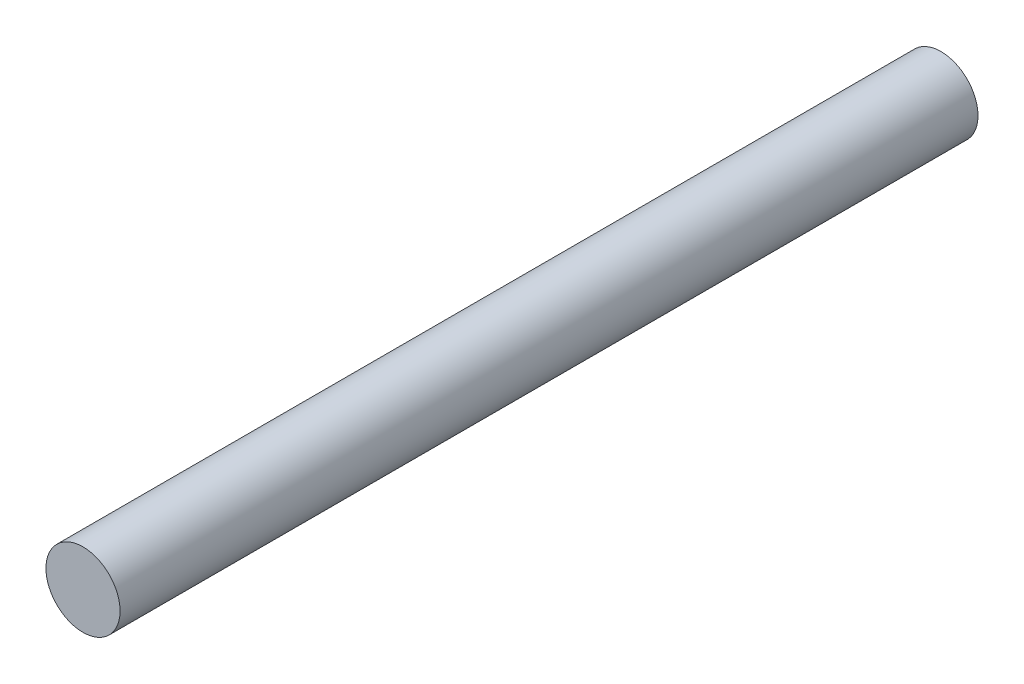
ISO-10303-21;
HEADER;
FILE_DESCRIPTION(('STEP AP214'),'2;1');
FILE_NAME('part.step','',(''),(''),'','','');
FILE_SCHEMA(('AUTOMOTIVE_DESIGN { 1 0 10303 214 1 1 1 1 }'));
ENDSEC;
DATA;
#1=APPLICATION_CONTEXT('core data for automotive mechanical design processes');
#2=APPLICATION_PROTOCOL_DEFINITION('international standard','automotive_design',2000,#1);
#3=PRODUCT_CONTEXT('',#1,'mechanical');
#4=PRODUCT('Part','Part','',(#3));
#5=PRODUCT_RELATED_PRODUCT_CATEGORY('part','',(#4));
#6=PRODUCT_DEFINITION_FORMATION('','',#4);
#7=PRODUCT_DEFINITION_CONTEXT('part definition',#1,'design');
#8=PRODUCT_DEFINITION('design','',#6,#7);
#9=PRODUCT_DEFINITION_SHAPE('','',#8);
#10=(LENGTH_UNIT() NAMED_UNIT(*) SI_UNIT(.MILLI.,.METRE.));
#11=(NAMED_UNIT(*) PLANE_ANGLE_UNIT() SI_UNIT($,.RADIAN.));
#12=(NAMED_UNIT(*) SI_UNIT($,.STERADIAN.) SOLID_ANGLE_UNIT());
#13=UNCERTAINTY_MEASURE_WITH_UNIT(LENGTH_MEASURE(1.E-05),#10,'distance_accuracy_value','');
#14=(GEOMETRIC_REPRESENTATION_CONTEXT(3) GLOBAL_UNCERTAINTY_ASSIGNED_CONTEXT((#13)) GLOBAL_UNIT_ASSIGNED_CONTEXT((#10,
#11,#12)) REPRESENTATION_CONTEXT('',''));
#15=CARTESIAN_POINT('',(0.,0.,0.));
#16=DIRECTION('',(0.,0.,1.));
#17=DIRECTION('',(1.,0.,0.));
#18=AXIS2_PLACEMENT_3D('',#15,#16,#17);
#19=CARTESIAN_POINT('',(0.,0.,46.295));
#20=DIRECTION('',(0.,0.,-1.));
#21=DIRECTION('',(-1.,0.,0.));
#22=AXIS2_PLACEMENT_3D('',#19,#20,#21);
#23=CYLINDRICAL_SURFACE('',#22,4.);
#24=CARTESIAN_POINT('',(0.,0.,46.295));
#25=DIRECTION('',(0.,0.,1.));
#26=DIRECTION('',(1.,0.,0.));
#27=AXIS2_PLACEMENT_3D('',#24,#25,#26);
#28=CIRCLE('',#27,4.);
#29=CARTESIAN_POINT('',(4.,0.,46.295));
#30=VERTEX_POINT('',#29);
#31=EDGE_CURVE('E10',#30,#30,#28,.T.);
#32=ORIENTED_EDGE('',*,*,#31,.F.);
#33=EDGE_LOOP('',(#32));
#34=FACE_BOUND('',#33,.T.);
#35=CARTESIAN_POINT('',(0.,0.,-46.295));
#36=DIRECTION('',(0.,0.,1.));
#37=DIRECTION('',(1.,0.,0.));
#38=AXIS2_PLACEMENT_3D('',#35,#36,#37);
#39=CIRCLE('',#38,4.);
#40=CARTESIAN_POINT('',(4.,0.,-46.295));
#41=VERTEX_POINT('',#40);
#42=EDGE_CURVE('E40',#41,#41,#39,.T.);
#43=ORIENTED_EDGE('',*,*,#42,.T.);
#44=EDGE_LOOP('',(#43));
#45=FACE_BOUND('',#44,.T.);
#46=ADVANCED_FACE('F37',(#34,#45),#23,.T.);
#47=CARTESIAN_POINT('',(0.,0.,46.295));
#48=DIRECTION('',(0.,0.,1.));
#49=DIRECTION('',(1.,0.,0.));
#50=AXIS2_PLACEMENT_3D('',#47,#48,#49);
#51=PLANE('',#50);
#52=ORIENTED_EDGE('',*,*,#31,.T.);
#53=EDGE_LOOP('',(#52));
#54=FACE_BOUND('',#53,.T.);
#55=ADVANCED_FACE('F54',(#54),#51,.T.);
#56=CARTESIAN_POINT('',(0.,0.,-46.295));
#57=DIRECTION('',(0.,0.,1.));
#58=DIRECTION('',(1.,0.,0.));
#59=AXIS2_PLACEMENT_3D('',#56,#57,#58);
#60=PLANE('',#59);
#61=ORIENTED_EDGE('',*,*,#42,.F.);
#62=EDGE_LOOP('',(#61));
#63=FACE_BOUND('',#62,.T.);
#64=ADVANCED_FACE('F52',(#63),#60,.F.);
#65=CLOSED_SHELL('',(#46,#55,#64));
#66=MANIFOLD_SOLID_BREP('B2',#65);
#67=ADVANCED_BREP_SHAPE_REPRESENTATION('',(#18,#66),#14);
#68=SHAPE_DEFINITION_REPRESENTATION(#9,#67);
ENDSEC;
END-ISO-10303-21;
